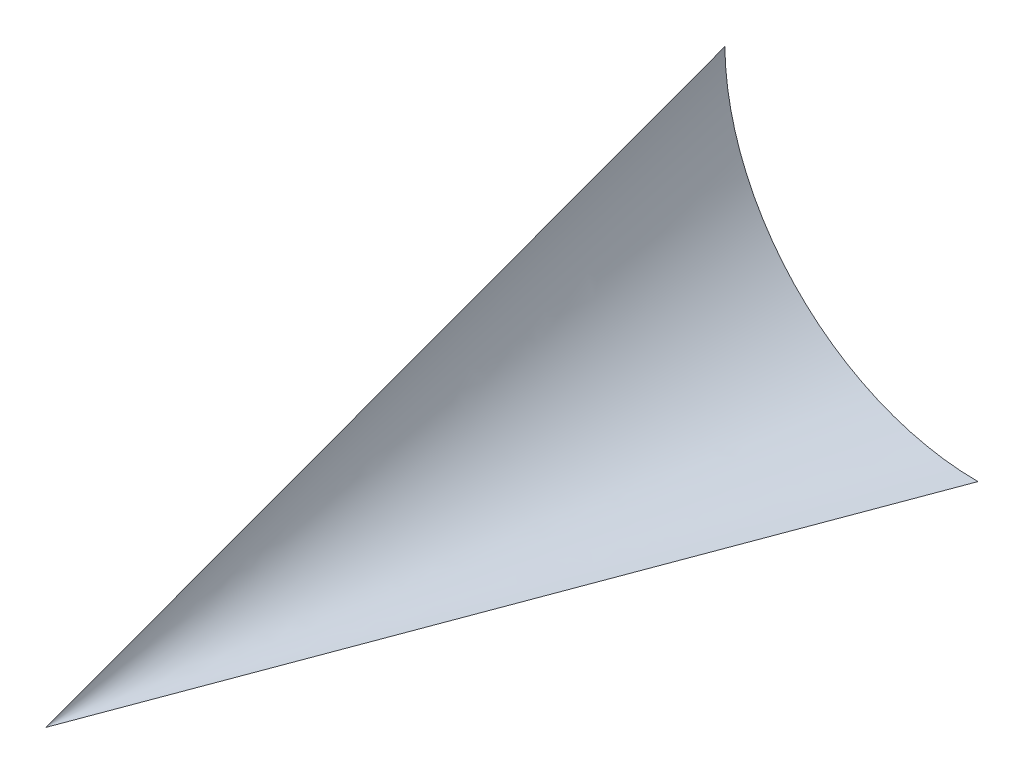
ISO-10303-21;
HEADER;
FILE_DESCRIPTION(('STEP AP214'),'2;1');
FILE_NAME('part.step','',(''),(''),'','','');
FILE_SCHEMA(('AUTOMOTIVE_DESIGN { 1 0 10303 214 1 1 1 1 }'));
ENDSEC;
DATA;
#1=APPLICATION_CONTEXT('core data for automotive mechanical design processes');
#2=APPLICATION_PROTOCOL_DEFINITION('international standard','automotive_design',2000,#1);
#3=PRODUCT_CONTEXT('',#1,'mechanical');
#4=PRODUCT('Part','Part','',(#3));
#5=PRODUCT_RELATED_PRODUCT_CATEGORY('part','',(#4));
#6=PRODUCT_DEFINITION_FORMATION('','',#4);
#7=PRODUCT_DEFINITION_CONTEXT('part definition',#1,'design');
#8=PRODUCT_DEFINITION('design','',#6,#7);
#9=PRODUCT_DEFINITION_SHAPE('','',#8);
#10=(LENGTH_UNIT() NAMED_UNIT(*) SI_UNIT(.MILLI.,.METRE.));
#11=(NAMED_UNIT(*) PLANE_ANGLE_UNIT() SI_UNIT($,.RADIAN.));
#12=(NAMED_UNIT(*) SI_UNIT($,.STERADIAN.) SOLID_ANGLE_UNIT());
#13=UNCERTAINTY_MEASURE_WITH_UNIT(LENGTH_MEASURE(1.E-05),#10,'distance_accuracy_value','');
#14=(GEOMETRIC_REPRESENTATION_CONTEXT(3) GLOBAL_UNCERTAINTY_ASSIGNED_CONTEXT((#13)) GLOBAL_UNIT_ASSIGNED_CONTEXT((#10,
#11,#12)) REPRESENTATION_CONTEXT('',''));
#15=CARTESIAN_POINT('',(0.,0.,0.));
#16=DIRECTION('',(0.,0.,1.));
#17=DIRECTION('',(1.,0.,0.));
#18=AXIS2_PLACEMENT_3D('',#15,#16,#17);
#19=CARTESIAN_POINT('',(55.7829436201638,55.7870570469598,0.));
#20=DIRECTION('',(0.,0.,1.));
#21=DIRECTION('',(1.,0.,0.));
#22=AXIS2_PLACEMENT_3D('',#19,#20,#21);
#23=PLANE('',#22);
#24=CARTESIAN_POINT('',(55.7829436201638,55.7870570469598,0.));
#25=DIRECTION('',(0.,0.,-1.));
#26=DIRECTION('',(1.,0.,0.));
#27=AXIS2_PLACEMENT_3D('',#24,#25,#26);
#28=CIRCLE('',#27,55.7870570469598);
#29=CARTESIAN_POINT('',(55.7829436201638,0.,0.));
#30=VERTEX_POINT('',#29);
#31=CARTESIAN_POINT('',(0.,55.1096096096096,0.));
#32=VERTEX_POINT('',#31);
#33=EDGE_CURVE('E83',#30,#32,#28,.T.);
#34=ORIENTED_EDGE('',*,*,#33,.F.);
#35=DIRECTION('',(1.,0.,0.));
#36=VECTOR('',#35,1.);
#37=CARTESIAN_POINT('',(0.,0.,0.));
#38=LINE('',#37,#36);
#39=CARTESIAN_POINT('',(0.,0.,0.));
#40=VERTEX_POINT('',#39);
#41=EDGE_CURVE('E65',#40,#30,#38,.T.);
#42=ORIENTED_EDGE('',*,*,#41,.F.);
#43=DIRECTION('',(0.,-1.,0.));
#44=VECTOR('',#43,1.);
#45=CARTESIAN_POINT('',(0.,55.1096096096096,0.));
#46=LINE('',#45,#44);
#47=EDGE_CURVE('E81',#32,#40,#46,.T.);
#48=ORIENTED_EDGE('',*,*,#47,.F.);
#49=EDGE_LOOP('',(#34,#42,#48));
#50=FACE_BOUND('',#49,.T.);
#51=ADVANCED_FACE('F43',(#50),#23,.F.);
#52=CARTESIAN_POINT('',(0.,0.,0.));
#53=DIRECTION('',(-1.,0.,0.));
#54=DIRECTION('',(0.,0.,1.));
#55=AXIS2_PLACEMENT_3D('',#52,#53,#54);
#56=PLANE('',#55);
#57=DIRECTION('',(0.,0.345718302210861,-0.938338348100748));
#58=VECTOR('',#57,1.);
#59=CARTESIAN_POINT('',(0.,0.,149.57686565873));
#60=LINE('',#59,#58);
#61=CARTESIAN_POINT('',(0.,0.,149.57686565873));
#62=VERTEX_POINT('',#61);
#63=EDGE_CURVE('E72',#62,#32,#60,.T.);
#64=ORIENTED_EDGE('',*,*,#63,.T.);
#65=ORIENTED_EDGE('',*,*,#47,.T.);
#66=DIRECTION('',(0.,0.,-1.));
#67=VECTOR('',#66,1.);
#68=CARTESIAN_POINT('',(0.,0.,149.57686565873));
#69=LINE('',#68,#67);
#70=EDGE_CURVE('E57',#62,#40,#69,.T.);
#71=ORIENTED_EDGE('',*,*,#70,.F.);
#72=EDGE_LOOP('',(#64,#65,#71));
#73=FACE_BOUND('',#72,.T.);
#74=ADVANCED_FACE('F94',(#73),#56,.T.);
#75=CARTESIAN_POINT('',(0.,0.,0.));
#76=DIRECTION('',(0.,-1.,0.));
#77=DIRECTION('',(0.,0.,-1.));
#78=AXIS2_PLACEMENT_3D('',#75,#76,#77);
#79=PLANE('',#78);
#80=ORIENTED_EDGE('',*,*,#70,.T.);
#81=ORIENTED_EDGE('',*,*,#41,.T.);
#82=DIRECTION('',(0.349429299317029,0.,-0.936962733932791));
#83=VECTOR('',#82,1.);
#84=CARTESIAN_POINT('',(27.8914718100819,0.,74.7884328293651));
#85=LINE('',#84,#83);
#86=EDGE_CURVE('E12',#62,#30,#85,.T.);
#87=ORIENTED_EDGE('',*,*,#86,.F.);
#88=EDGE_LOOP('',(#80,#81,#87));
#89=FACE_BOUND('',#88,.T.);
#90=ADVANCED_FACE('F111',(#89),#79,.T.);
#91=CARTESIAN_POINT('',(0.,0.,149.57686565873));
#92=CARTESIAN_POINT('',(0.,55.1096096096096,0.));
#93=CARTESIAN_POINT('',(0.,0.,149.57686565873));
#94=CARTESIAN_POINT('',(0.0396758556828358,51.842587109245,0.));
#95=CARTESIAN_POINT('',(0.,0.,149.57686565873));
#96=CARTESIAN_POINT('',(0.369467242359586,48.4587144845164,0.));
#97=CARTESIAN_POINT('',(0.,0.,149.57686565873));
#98=CARTESIAN_POINT('',(1.71355780263142,41.6145665706598,0.));
#99=CARTESIAN_POINT('',(0.,0.,149.57686565873));
#100=CARTESIAN_POINT('',(2.72892109534491,38.1549890002319,0.));
#101=CARTESIAN_POINT('',(0.,0.,149.57686565873));
#102=CARTESIAN_POINT('',(5.49062997539533,31.367754888121,0.));
#103=CARTESIAN_POINT('',(0.,0.,149.57686565873));
#104=CARTESIAN_POINT('',(7.23756985429175,28.0414445478321,0.));
#105=CARTESIAN_POINT('',(0.,0.,149.57686565873));
#106=CARTESIAN_POINT('',(11.422160105178,21.7489429253383,0.));
#107=CARTESIAN_POINT('',(0.,0.,149.57686565873));
#108=CARTESIAN_POINT('',(13.8595191443417,18.7843362206048,0.));
#109=CARTESIAN_POINT('',(0.,0.,149.57686565873));
#110=CARTESIAN_POINT('',(19.2920462519889,13.4173830147177,0.));
#111=CARTESIAN_POINT('',(0.,0.,149.57686565873));
#112=CARTESIAN_POINT('',(22.286032315109,11.0162042514047,0.));
#113=CARTESIAN_POINT('',(0.,0.,149.57686565873));
#114=CARTESIAN_POINT('',(28.628885333531,6.90833523893665,0.));
#115=CARTESIAN_POINT('',(0.,0.,149.57686565873));
#116=CARTESIAN_POINT('',(31.976164290413,5.20191705888636,0.));
#117=CARTESIAN_POINT('',(0.,0.,149.57686565873));
#118=CARTESIAN_POINT('',(38.7964346283151,2.52283226204174,0.));
#119=CARTESIAN_POINT('',(0.,0.,149.57686565873));
#120=CARTESIAN_POINT('',(42.2680871239534,1.54955504997596,0.));
#121=CARTESIAN_POINT('',(0.,0.,149.57686565873));
#122=CARTESIAN_POINT('',(49.1280522873819,0.288675175639878,0.));
#123=CARTESIAN_POINT('',(0.,0.,149.57686565873));
#124=CARTESIAN_POINT('',(52.5156802099973,0.,0.));
#125=CARTESIAN_POINT('',(0.,0.,149.57686565873));
#126=CARTESIAN_POINT('',(55.7829436201638,0.,0.));
#127=B_SPLINE_SURFACE_WITH_KNOTS('',3,1,((#91,#92),(#93,#94),(#95,#96),(#97,#98),(#99,#100),
(#101,#102),(#103,#104),(#105,#106),(#107,#108),(#109,#110),(#111,#112),(#113,#114),(#115,#116),
(#117,#118),(#119,#120),(#121,#122),(#123,#124),(#125,#126)),.UNSPECIFIED.,.F.,.F.,.F.,(4,2,2,2,
2,2,2,2,4),(2,2),(0.,0.125,0.25,0.375,0.5,0.625,0.75,0.875,1.),(0.,1.),.UNSPECIFIED.);
#128=ORIENTED_EDGE('',*,*,#86,.T.);
#129=ORIENTED_EDGE('',*,*,#33,.T.);
#130=ORIENTED_EDGE('',*,*,#63,.F.);
#131=EDGE_LOOP('',(#128,#129,#130));
#132=FACE_BOUND('',#131,.T.);
#133=ADVANCED_FACE('F45',(#132),#127,.T.);
#134=CLOSED_SHELL('',(#51,#74,#90,#133));
#135=MANIFOLD_SOLID_BREP('B2',#134);
#136=ADVANCED_BREP_SHAPE_REPRESENTATION('',(#18,#135),#14);
#137=SHAPE_DEFINITION_REPRESENTATION(#9,#136);
ENDSEC;
END-ISO-10303-21;
